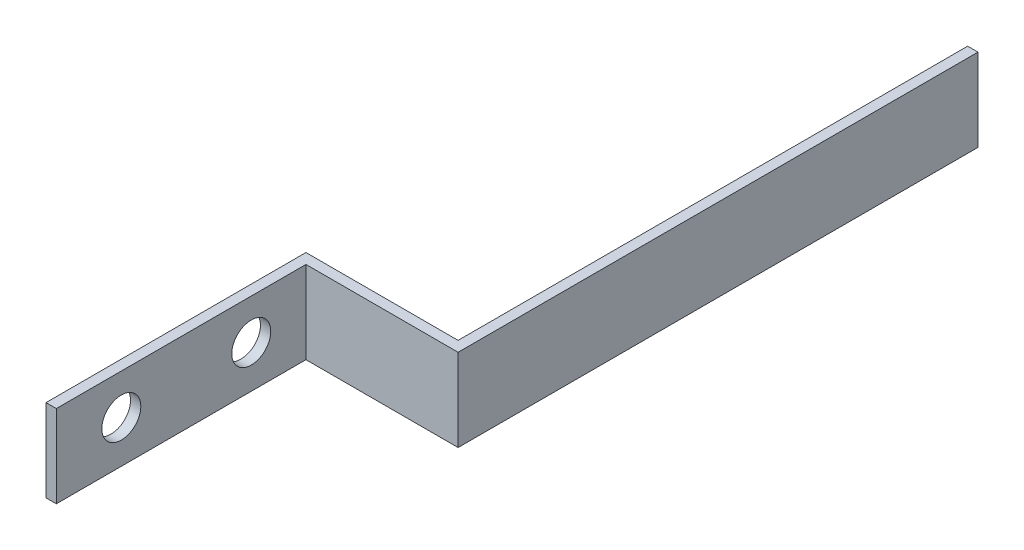
ISO-10303-21;
HEADER;
FILE_DESCRIPTION(('STEP AP214'),'2;1');
FILE_NAME('part.step','',(''),(''),'','','');
FILE_SCHEMA(('AUTOMOTIVE_DESIGN { 1 0 10303 214 1 1 1 1 }'));
ENDSEC;
DATA;
#1=APPLICATION_CONTEXT('core data for automotive mechanical design processes');
#2=APPLICATION_PROTOCOL_DEFINITION('international standard','automotive_design',2000,#1);
#3=PRODUCT_CONTEXT('',#1,'mechanical');
#4=PRODUCT('Part','Part','',(#3));
#5=PRODUCT_RELATED_PRODUCT_CATEGORY('part','',(#4));
#6=PRODUCT_DEFINITION_FORMATION('','',#4);
#7=PRODUCT_DEFINITION_CONTEXT('part definition',#1,'design');
#8=PRODUCT_DEFINITION('design','',#6,#7);
#9=PRODUCT_DEFINITION_SHAPE('','',#8);
#10=(LENGTH_UNIT() NAMED_UNIT(*) SI_UNIT(.MILLI.,.METRE.));
#11=(NAMED_UNIT(*) PLANE_ANGLE_UNIT() SI_UNIT($,.RADIAN.));
#12=(NAMED_UNIT(*) SI_UNIT($,.STERADIAN.) SOLID_ANGLE_UNIT());
#13=UNCERTAINTY_MEASURE_WITH_UNIT(LENGTH_MEASURE(1.E-05),#10,'distance_accuracy_value','');
#14=(GEOMETRIC_REPRESENTATION_CONTEXT(3) GLOBAL_UNCERTAINTY_ASSIGNED_CONTEXT((#13)) GLOBAL_UNIT_ASSIGNED_CONTEXT((#10,
#11,#12)) REPRESENTATION_CONTEXT('',''));
#15=CARTESIAN_POINT('',(0.,0.,0.));
#16=DIRECTION('',(0.,0.,1.));
#17=DIRECTION('',(1.,0.,0.));
#18=AXIS2_PLACEMENT_3D('',#15,#16,#17);
#19=CARTESIAN_POINT('',(3.175,25.4,0.));
#20=DIRECTION('',(0.,0.,-1.));
#21=DIRECTION('',(-1.,0.,0.));
#22=AXIS2_PLACEMENT_3D('',#19,#20,#21);
#23=PLANE('',#22);
#24=DIRECTION('',(1.,0.,0.));
#25=VECTOR('',#24,1.);
#26=CARTESIAN_POINT('',(3.175,0.,0.));
#27=LINE('',#26,#25);
#28=CARTESIAN_POINT('',(0.,0.,0.));
#29=VERTEX_POINT('',#28);
#30=CARTESIAN_POINT('',(3.175,0.,0.));
#31=VERTEX_POINT('',#30);
#32=EDGE_CURVE('E129',#29,#31,#27,.T.);
#33=ORIENTED_EDGE('',*,*,#32,.T.);
#34=DIRECTION('',(0.,-1.,0.));
#35=VECTOR('',#34,1.);
#36=CARTESIAN_POINT('',(3.175,25.4,0.));
#37=LINE('',#36,#35);
#38=CARTESIAN_POINT('',(3.175,25.4,0.));
#39=VERTEX_POINT('',#38);
#40=EDGE_CURVE('E11',#39,#31,#37,.T.);
#41=ORIENTED_EDGE('',*,*,#40,.F.);
#42=DIRECTION('',(1.,0.,0.));
#43=VECTOR('',#42,1.);
#44=CARTESIAN_POINT('',(3.175,25.4,0.));
#45=LINE('',#44,#43);
#46=CARTESIAN_POINT('',(0.,25.4,0.));
#47=VERTEX_POINT('',#46);
#48=EDGE_CURVE('E144',#47,#39,#45,.T.);
#49=ORIENTED_EDGE('',*,*,#48,.F.);
#50=DIRECTION('',(0.,-1.,0.));
#51=VECTOR('',#50,1.);
#52=CARTESIAN_POINT('',(0.,25.4,0.));
#53=LINE('',#52,#51);
#54=EDGE_CURVE('E125',#47,#29,#53,.T.);
#55=ORIENTED_EDGE('',*,*,#54,.T.);
#56=EDGE_LOOP('',(#33,#41,#49,#55));
#57=FACE_BOUND('',#56,.T.);
#58=ADVANCED_FACE('F31',(#57),#23,.F.);
#59=CARTESIAN_POINT('',(3.17499999999998,25.4,-76.825));
#60=DIRECTION('',(-1.,0.,0.));
#61=DIRECTION('',(0.,0.,1.));
#62=AXIS2_PLACEMENT_3D('',#59,#60,#61);
#63=PLANE('',#62);
#64=CARTESIAN_POINT('',(3.17499999999999,13.,-20.));
#65=DIRECTION('',(1.,0.,0.));
#66=DIRECTION('',(0.,0.,-1.));
#67=AXIS2_PLACEMENT_3D('',#64,#65,#66);
#68=CIRCLE('',#67,6.);
#69=CARTESIAN_POINT('',(3.17499999999999,13.,-26.));
#70=VERTEX_POINT('',#69);
#71=EDGE_CURVE('E164',#70,#70,#68,.T.);
#72=ORIENTED_EDGE('',*,*,#71,.F.);
#73=EDGE_LOOP('',(#72));
#74=FACE_BOUND('',#73,.T.);
#75=CARTESIAN_POINT('',(3.17499999999999,13.,-60.));
#76=DIRECTION('',(1.,0.,0.));
#77=DIRECTION('',(0.,0.,-1.));
#78=AXIS2_PLACEMENT_3D('',#75,#76,#77);
#79=CIRCLE('',#78,6.);
#80=CARTESIAN_POINT('',(3.17499999999999,13.,-66.));
#81=VERTEX_POINT('',#80);
#82=EDGE_CURVE('E156',#81,#81,#79,.T.);
#83=ORIENTED_EDGE('',*,*,#82,.F.);
#84=EDGE_LOOP('',(#83));
#85=FACE_BOUND('',#84,.T.);
#86=DIRECTION('',(0.,0.,-1.));
#87=VECTOR('',#86,1.);
#88=CARTESIAN_POINT('',(3.17499999999998,0.,-76.825));
#89=LINE('',#88,#87);
#90=CARTESIAN_POINT('',(3.17499999999998,0.,-76.825));
#91=VERTEX_POINT('',#90);
#92=EDGE_CURVE('E132',#31,#91,#89,.T.);
#93=ORIENTED_EDGE('',*,*,#92,.T.);
#94=DIRECTION('',(0.,-1.,0.));
#95=VECTOR('',#94,1.);
#96=CARTESIAN_POINT('',(3.17499999999998,25.4,-76.825));
#97=LINE('',#96,#95);
#98=CARTESIAN_POINT('',(3.17499999999998,25.4,-76.825));
#99=VERTEX_POINT('',#98);
#100=EDGE_CURVE('E40',#99,#91,#97,.T.);
#101=ORIENTED_EDGE('',*,*,#100,.F.);
#102=DIRECTION('',(0.,0.,-1.));
#103=VECTOR('',#102,1.);
#104=CARTESIAN_POINT('',(3.17499999999998,25.4,-76.825));
#105=LINE('',#104,#103);
#106=EDGE_CURVE('E92',#39,#99,#105,.T.);
#107=ORIENTED_EDGE('',*,*,#106,.F.);
#108=ORIENTED_EDGE('',*,*,#40,.T.);
#109=EDGE_LOOP('',(#93,#101,#107,#108));
#110=FACE_BOUND('',#109,.T.);
#111=ADVANCED_FACE('F201',(#74,#85,#110),#63,.F.);
#112=CARTESIAN_POINT('',(50.,25.4,-76.825));
#113=DIRECTION('',(0.,0.,-1.));
#114=DIRECTION('',(-1.,0.,0.));
#115=AXIS2_PLACEMENT_3D('',#112,#113,#114);
#116=PLANE('',#115);
#117=DIRECTION('',(1.,0.,0.));
#118=VECTOR('',#117,1.);
#119=CARTESIAN_POINT('',(50.,0.,-76.825));
#120=LINE('',#119,#118);
#121=CARTESIAN_POINT('',(50.,0.,-76.825));
#122=VERTEX_POINT('',#121);
#123=EDGE_CURVE('E135',#91,#122,#120,.T.);
#124=ORIENTED_EDGE('',*,*,#123,.T.);
#125=DIRECTION('',(0.,-1.,0.));
#126=VECTOR('',#125,1.);
#127=CARTESIAN_POINT('',(50.,25.4,-76.825));
#128=LINE('',#127,#126);
#129=CARTESIAN_POINT('',(50.,25.4,-76.825));
#130=VERTEX_POINT('',#129);
#131=EDGE_CURVE('E151',#130,#122,#128,.T.);
#132=ORIENTED_EDGE('',*,*,#131,.F.);
#133=DIRECTION('',(1.,0.,0.));
#134=VECTOR('',#133,1.);
#135=CARTESIAN_POINT('',(50.,25.4,-76.825));
#136=LINE('',#135,#134);
#137=EDGE_CURVE('E169',#99,#130,#136,.T.);
#138=ORIENTED_EDGE('',*,*,#137,.F.);
#139=ORIENTED_EDGE('',*,*,#100,.T.);
#140=EDGE_LOOP('',(#124,#132,#138,#139));
#141=FACE_BOUND('',#140,.T.);
#142=ADVANCED_FACE('F205',(#141),#116,.F.);
#143=CARTESIAN_POINT('',(50.,25.4,-236.825));
#144=DIRECTION('',(-1.,0.,0.));
#145=DIRECTION('',(0.,0.,1.));
#146=AXIS2_PLACEMENT_3D('',#143,#144,#145);
#147=PLANE('',#146);
#148=DIRECTION('',(0.,0.,-1.));
#149=VECTOR('',#148,1.);
#150=CARTESIAN_POINT('',(50.,0.,-236.825));
#151=LINE('',#150,#149);
#152=CARTESIAN_POINT('',(50.,0.,-236.825));
#153=VERTEX_POINT('',#152);
#154=EDGE_CURVE('E137',#122,#153,#151,.T.);
#155=ORIENTED_EDGE('',*,*,#154,.T.);
#156=DIRECTION('',(0.,-1.,0.));
#157=VECTOR('',#156,1.);
#158=CARTESIAN_POINT('',(50.,25.4,-236.825));
#159=LINE('',#158,#157);
#160=CARTESIAN_POINT('',(50.,25.4,-236.825));
#161=VERTEX_POINT('',#160);
#162=EDGE_CURVE('E148',#161,#153,#159,.T.);
#163=ORIENTED_EDGE('',*,*,#162,.F.);
#164=DIRECTION('',(0.,0.,-1.));
#165=VECTOR('',#164,1.);
#166=CARTESIAN_POINT('',(50.,25.4,-236.825));
#167=LINE('',#166,#165);
#168=EDGE_CURVE('E171',#130,#161,#167,.T.);
#169=ORIENTED_EDGE('',*,*,#168,.F.);
#170=ORIENTED_EDGE('',*,*,#131,.T.);
#171=EDGE_LOOP('',(#155,#163,#169,#170));
#172=FACE_BOUND('',#171,.T.);
#173=ADVANCED_FACE('F177',(#172),#147,.F.);
#174=CARTESIAN_POINT('',(46.825,25.4,-236.825));
#175=DIRECTION('',(0.,0.,1.));
#176=DIRECTION('',(1.,0.,0.));
#177=AXIS2_PLACEMENT_3D('',#174,#175,#176);
#178=PLANE('',#177);
#179=DIRECTION('',(-1.,0.,0.));
#180=VECTOR('',#179,1.);
#181=CARTESIAN_POINT('',(46.825,0.,-236.825));
#182=LINE('',#181,#180);
#183=CARTESIAN_POINT('',(46.825,0.,-236.825));
#184=VERTEX_POINT('',#183);
#185=EDGE_CURVE('E139',#153,#184,#182,.T.);
#186=ORIENTED_EDGE('',*,*,#185,.T.);
#187=DIRECTION('',(0.,-1.,0.));
#188=VECTOR('',#187,1.);
#189=CARTESIAN_POINT('',(46.825,25.4,-236.825));
#190=LINE('',#189,#188);
#191=CARTESIAN_POINT('',(46.825,25.4,-236.825));
#192=VERTEX_POINT('',#191);
#193=EDGE_CURVE('E120',#192,#184,#190,.T.);
#194=ORIENTED_EDGE('',*,*,#193,.F.);
#195=DIRECTION('',(-1.,0.,0.));
#196=VECTOR('',#195,1.);
#197=CARTESIAN_POINT('',(46.825,25.4,-236.825));
#198=LINE('',#197,#196);
#199=EDGE_CURVE('E111',#161,#192,#198,.T.);
#200=ORIENTED_EDGE('',*,*,#199,.F.);
#201=ORIENTED_EDGE('',*,*,#162,.T.);
#202=EDGE_LOOP('',(#186,#194,#200,#201));
#203=FACE_BOUND('',#202,.T.);
#204=ADVANCED_FACE('F181',(#203),#178,.F.);
#205=CARTESIAN_POINT('',(46.825,25.4,-80.));
#206=DIRECTION('',(1.,0.,0.));
#207=DIRECTION('',(0.,0.,-1.));
#208=AXIS2_PLACEMENT_3D('',#205,#206,#207);
#209=PLANE('',#208);
#210=DIRECTION('',(0.,0.,1.));
#211=VECTOR('',#210,1.);
#212=CARTESIAN_POINT('',(46.825,0.,-80.));
#213=LINE('',#212,#211);
#214=CARTESIAN_POINT('',(46.825,0.,-80.));
#215=VERTEX_POINT('',#214);
#216=EDGE_CURVE('E119',#184,#215,#213,.T.);
#217=ORIENTED_EDGE('',*,*,#216,.T.);
#218=DIRECTION('',(0.,-1.,0.));
#219=VECTOR('',#218,1.);
#220=CARTESIAN_POINT('',(46.825,25.4,-80.));
#221=LINE('',#220,#219);
#222=CARTESIAN_POINT('',(46.825,25.4,-80.));
#223=VERTEX_POINT('',#222);
#224=EDGE_CURVE('E116',#223,#215,#221,.T.);
#225=ORIENTED_EDGE('',*,*,#224,.F.);
#226=DIRECTION('',(0.,0.,1.));
#227=VECTOR('',#226,1.);
#228=CARTESIAN_POINT('',(46.825,25.4,-80.));
#229=LINE('',#228,#227);
#230=EDGE_CURVE('E105',#192,#223,#229,.T.);
#231=ORIENTED_EDGE('',*,*,#230,.F.);
#232=ORIENTED_EDGE('',*,*,#193,.T.);
#233=EDGE_LOOP('',(#217,#225,#231,#232));
#234=FACE_BOUND('',#233,.T.);
#235=ADVANCED_FACE('F117',(#234),#209,.F.);
#236=CARTESIAN_POINT('',(0.,25.4,-80.));
#237=DIRECTION('',(0.,0.,1.));
#238=DIRECTION('',(1.,0.,0.));
#239=AXIS2_PLACEMENT_3D('',#236,#237,#238);
#240=PLANE('',#239);
#241=DIRECTION('',(-1.,0.,0.));
#242=VECTOR('',#241,1.);
#243=CARTESIAN_POINT('',(0.,0.,-80.));
#244=LINE('',#243,#242);
#245=CARTESIAN_POINT('',(0.,0.,-80.));
#246=VERTEX_POINT('',#245);
#247=EDGE_CURVE('E78',#215,#246,#244,.T.);
#248=ORIENTED_EDGE('',*,*,#247,.T.);
#249=DIRECTION('',(0.,-1.,0.));
#250=VECTOR('',#249,1.);
#251=CARTESIAN_POINT('',(0.,25.4,-80.));
#252=LINE('',#251,#250);
#253=CARTESIAN_POINT('',(0.,25.4,-80.));
#254=VERTEX_POINT('',#253);
#255=EDGE_CURVE('E121',#254,#246,#252,.T.);
#256=ORIENTED_EDGE('',*,*,#255,.F.);
#257=DIRECTION('',(-1.,0.,0.));
#258=VECTOR('',#257,1.);
#259=CARTESIAN_POINT('',(0.,25.4,-80.));
#260=LINE('',#259,#258);
#261=EDGE_CURVE('E109',#223,#254,#260,.T.);
#262=ORIENTED_EDGE('',*,*,#261,.F.);
#263=ORIENTED_EDGE('',*,*,#224,.T.);
#264=EDGE_LOOP('',(#248,#256,#262,#263));
#265=FACE_BOUND('',#264,.T.);
#266=ADVANCED_FACE('F123',(#265),#240,.F.);
#267=CARTESIAN_POINT('',(0.,25.4,0.));
#268=DIRECTION('',(1.,0.,0.));
#269=DIRECTION('',(0.,0.,-1.));
#270=AXIS2_PLACEMENT_3D('',#267,#268,#269);
#271=PLANE('',#270);
#272=CARTESIAN_POINT('',(0.,13.,-20.));
#273=DIRECTION('',(1.,0.,0.));
#274=DIRECTION('',(0.,0.,-1.));
#275=AXIS2_PLACEMENT_3D('',#272,#273,#274);
#276=CIRCLE('',#275,6.);
#277=CARTESIAN_POINT('',(0.,13.,-26.));
#278=VERTEX_POINT('',#277);
#279=EDGE_CURVE('E34',#278,#278,#276,.T.);
#280=ORIENTED_EDGE('',*,*,#279,.T.);
#281=EDGE_LOOP('',(#280));
#282=FACE_BOUND('',#281,.T.);
#283=CARTESIAN_POINT('',(0.,13.,-60.));
#284=DIRECTION('',(1.,0.,0.));
#285=DIRECTION('',(0.,0.,-1.));
#286=AXIS2_PLACEMENT_3D('',#283,#284,#285);
#287=CIRCLE('',#286,6.);
#288=CARTESIAN_POINT('',(0.,13.,-66.));
#289=VERTEX_POINT('',#288);
#290=EDGE_CURVE('E133',#289,#289,#287,.T.);
#291=ORIENTED_EDGE('',*,*,#290,.T.);
#292=EDGE_LOOP('',(#291));
#293=FACE_BOUND('',#292,.T.);
#294=DIRECTION('',(0.,0.,1.));
#295=VECTOR('',#294,1.);
#296=CARTESIAN_POINT('',(0.,0.,0.));
#297=LINE('',#296,#295);
#298=EDGE_CURVE('E84',#246,#29,#297,.T.);
#299=ORIENTED_EDGE('',*,*,#298,.T.);
#300=ORIENTED_EDGE('',*,*,#54,.F.);
#301=DIRECTION('',(0.,0.,1.));
#302=VECTOR('',#301,1.);
#303=CARTESIAN_POINT('',(0.,25.4,0.));
#304=LINE('',#303,#302);
#305=EDGE_CURVE('E49',#254,#47,#304,.T.);
#306=ORIENTED_EDGE('',*,*,#305,.F.);
#307=ORIENTED_EDGE('',*,*,#255,.T.);
#308=EDGE_LOOP('',(#299,#300,#306,#307));
#309=FACE_BOUND('',#308,.T.);
#310=ADVANCED_FACE('F189',(#282,#293,#309),#271,.F.);
#311=CARTESIAN_POINT('',(0.,25.4,0.));
#312=DIRECTION('',(0.,-1.,0.));
#313=DIRECTION('',(0.,0.,-1.));
#314=AXIS2_PLACEMENT_3D('',#311,#312,#313);
#315=PLANE('',#314);
#316=ORIENTED_EDGE('',*,*,#48,.T.);
#317=ORIENTED_EDGE('',*,*,#106,.T.);
#318=ORIENTED_EDGE('',*,*,#137,.T.);
#319=ORIENTED_EDGE('',*,*,#168,.T.);
#320=ORIENTED_EDGE('',*,*,#199,.T.);
#321=ORIENTED_EDGE('',*,*,#230,.T.);
#322=ORIENTED_EDGE('',*,*,#261,.T.);
#323=ORIENTED_EDGE('',*,*,#305,.T.);
#324=EDGE_LOOP('',(#316,#317,#318,#319,#320,#321,#322,#323));
#325=FACE_BOUND('',#324,.T.);
#326=ADVANCED_FACE('F107',(#325),#315,.F.);
#327=CARTESIAN_POINT('',(0.,0.,0.));
#328=DIRECTION('',(0.,-1.,0.));
#329=DIRECTION('',(0.,0.,-1.));
#330=AXIS2_PLACEMENT_3D('',#327,#328,#329);
#331=PLANE('',#330);
#332=ORIENTED_EDGE('',*,*,#32,.F.);
#333=ORIENTED_EDGE('',*,*,#298,.F.);
#334=ORIENTED_EDGE('',*,*,#247,.F.);
#335=ORIENTED_EDGE('',*,*,#216,.F.);
#336=ORIENTED_EDGE('',*,*,#185,.F.);
#337=ORIENTED_EDGE('',*,*,#154,.F.);
#338=ORIENTED_EDGE('',*,*,#123,.F.);
#339=ORIENTED_EDGE('',*,*,#92,.F.);
#340=EDGE_LOOP('',(#332,#333,#334,#335,#336,#337,#338,#339));
#341=FACE_BOUND('',#340,.T.);
#342=ADVANCED_FACE('F184',(#341),#331,.T.);
#343=CARTESIAN_POINT('',(-22.225,13.,-60.));
#344=DIRECTION('',(1.,0.,0.));
#345=DIRECTION('',(0.,0.,-1.));
#346=AXIS2_PLACEMENT_3D('',#343,#344,#345);
#347=CYLINDRICAL_SURFACE('',#346,6.);
#348=ORIENTED_EDGE('',*,*,#82,.T.);
#349=EDGE_LOOP('',(#348));
#350=FACE_BOUND('',#349,.T.);
#351=ORIENTED_EDGE('',*,*,#290,.F.);
#352=EDGE_LOOP('',(#351));
#353=FACE_BOUND('',#352,.T.);
#354=ADVANCED_FACE('F243',(#350,#353),#347,.F.);
#355=CARTESIAN_POINT('',(-22.225,13.,-20.));
#356=DIRECTION('',(1.,0.,0.));
#357=DIRECTION('',(0.,0.,-1.));
#358=AXIS2_PLACEMENT_3D('',#355,#356,#357);
#359=CYLINDRICAL_SURFACE('',#358,6.);
#360=ORIENTED_EDGE('',*,*,#71,.T.);
#361=EDGE_LOOP('',(#360));
#362=FACE_BOUND('',#361,.T.);
#363=ORIENTED_EDGE('',*,*,#279,.F.);
#364=EDGE_LOOP('',(#363));
#365=FACE_BOUND('',#364,.T.);
#366=ADVANCED_FACE('F261',(#362,#365),#359,.F.);
#367=CLOSED_SHELL('',(#58,#111,#142,#173,#204,#235,#266,#310,#326,#342,#354,#366));
#368=MANIFOLD_SOLID_BREP('B2',#367);
#369=ADVANCED_BREP_SHAPE_REPRESENTATION('',(#18,#368),#14);
#370=SHAPE_DEFINITION_REPRESENTATION(#9,#369);
ENDSEC;
END-ISO-10303-21;
